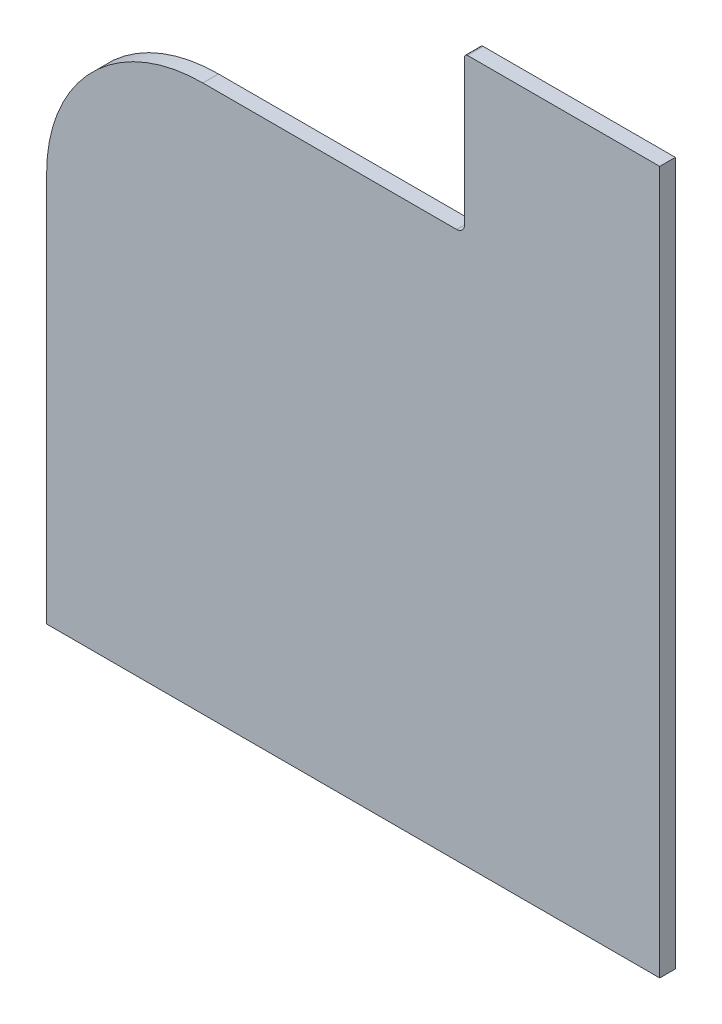
ISO-10303-21;
HEADER;
FILE_DESCRIPTION(('STEP AP214'),'2;1');
FILE_NAME('part.step','',(''),(''),'','','');
FILE_SCHEMA(('AUTOMOTIVE_DESIGN { 1 0 10303 214 1 1 1 1 }'));
ENDSEC;
DATA;
#1=APPLICATION_CONTEXT('core data for automotive mechanical design processes');
#2=APPLICATION_PROTOCOL_DEFINITION('international standard','automotive_design',2000,#1);
#3=PRODUCT_CONTEXT('',#1,'mechanical');
#4=PRODUCT('Part','Part','',(#3));
#5=PRODUCT_RELATED_PRODUCT_CATEGORY('part','',(#4));
#6=PRODUCT_DEFINITION_FORMATION('','',#4);
#7=PRODUCT_DEFINITION_CONTEXT('part definition',#1,'design');
#8=PRODUCT_DEFINITION('design','',#6,#7);
#9=PRODUCT_DEFINITION_SHAPE('','',#8);
#10=(LENGTH_UNIT() NAMED_UNIT(*) SI_UNIT(.MILLI.,.METRE.));
#11=(NAMED_UNIT(*) PLANE_ANGLE_UNIT() SI_UNIT($,.RADIAN.));
#12=(NAMED_UNIT(*) SI_UNIT($,.STERADIAN.) SOLID_ANGLE_UNIT());
#13=UNCERTAINTY_MEASURE_WITH_UNIT(LENGTH_MEASURE(1.E-05),#10,'distance_accuracy_value','');
#14=(GEOMETRIC_REPRESENTATION_CONTEXT(3) GLOBAL_UNCERTAINTY_ASSIGNED_CONTEXT((#13)) GLOBAL_UNIT_ASSIGNED_CONTEXT((#10,
#11,#12)) REPRESENTATION_CONTEXT('',''));
#15=CARTESIAN_POINT('',(0.,0.,0.));
#16=DIRECTION('',(0.,0.,1.));
#17=DIRECTION('',(1.,0.,0.));
#18=AXIS2_PLACEMENT_3D('',#15,#16,#17);
#19=CARTESIAN_POINT('',(285.,99.9999999999999,20.));
#20=DIRECTION('',(-1.,0.,0.));
#21=DIRECTION('',(0.,0.,1.));
#22=AXIS2_PLACEMENT_3D('',#19,#20,#21);
#23=PLANE('',#22);
#24=DIRECTION('',(0.,1.,0.));
#25=VECTOR('',#24,1.);
#26=CARTESIAN_POINT('',(285.,99.9999999999999,0.));
#27=LINE('',#26,#25);
#28=CARTESIAN_POINT('',(285.,-300.,0.));
#29=VERTEX_POINT('',#28);
#30=CARTESIAN_POINT('',(285.,600.,0.));
#31=VERTEX_POINT('',#30);
#32=EDGE_CURVE('E119',#29,#31,#27,.T.);
#33=ORIENTED_EDGE('',*,*,#32,.T.);
#34=DIRECTION('',(0.,0.,-1.));
#35=VECTOR('',#34,1.);
#36=CARTESIAN_POINT('',(285.,600.,20.));
#37=LINE('',#36,#35);
#38=CARTESIAN_POINT('',(285.,600.,20.));
#39=VERTEX_POINT('',#38);
#40=EDGE_CURVE('E118',#39,#31,#37,.T.);
#41=ORIENTED_EDGE('',*,*,#40,.F.);
#42=DIRECTION('',(0.,1.,0.));
#43=VECTOR('',#42,1.);
#44=CARTESIAN_POINT('',(285.,99.9999999999999,20.));
#45=LINE('',#44,#43);
#46=CARTESIAN_POINT('',(285.,-300.,20.));
#47=VERTEX_POINT('',#46);
#48=EDGE_CURVE('E105',#47,#39,#45,.T.);
#49=ORIENTED_EDGE('',*,*,#48,.F.);
#50=DIRECTION('',(0.,0.,-1.));
#51=VECTOR('',#50,1.);
#52=CARTESIAN_POINT('',(285.,-300.,20.));
#53=LINE('',#52,#51);
#54=EDGE_CURVE('E137',#47,#29,#53,.T.);
#55=ORIENTED_EDGE('',*,*,#54,.T.);
#56=EDGE_LOOP('',(#33,#41,#49,#55));
#57=FACE_BOUND('',#56,.T.);
#58=ADVANCED_FACE('F35',(#57),#23,.F.);
#59=CARTESIAN_POINT('',(285.,600.,20.));
#60=DIRECTION('',(0.,-1.,0.));
#61=DIRECTION('',(0.,0.,-1.));
#62=AXIS2_PLACEMENT_3D('',#59,#60,#61);
#63=PLANE('',#62);
#64=DIRECTION('',(-1.,0.,0.));
#65=VECTOR('',#64,1.);
#66=CARTESIAN_POINT('',(285.,600.,0.));
#67=LINE('',#66,#65);
#68=CARTESIAN_POINT('',(39.0000000000001,600.,0.));
#69=VERTEX_POINT('',#68);
#70=EDGE_CURVE('E139',#31,#69,#67,.T.);
#71=ORIENTED_EDGE('',*,*,#70,.T.);
#72=DIRECTION('',(0.,0.,-1.));
#73=VECTOR('',#72,1.);
#74=CARTESIAN_POINT('',(39.0000000000001,600.,20.));
#75=LINE('',#74,#73);
#76=CARTESIAN_POINT('',(39.0000000000001,600.,20.));
#77=VERTEX_POINT('',#76);
#78=EDGE_CURVE('E43',#69,#77,#75,.F.);
#79=ORIENTED_EDGE('',*,*,#78,.T.);
#80=DIRECTION('',(-1.,0.,0.));
#81=VECTOR('',#80,1.);
#82=CARTESIAN_POINT('',(285.,600.,20.));
#83=LINE('',#82,#81);
#84=EDGE_CURVE('E108',#39,#77,#83,.T.);
#85=ORIENTED_EDGE('',*,*,#84,.F.);
#86=ORIENTED_EDGE('',*,*,#40,.T.);
#87=EDGE_LOOP('',(#71,#79,#85,#86));
#88=FACE_BOUND('',#87,.T.);
#89=ADVANCED_FACE('F123',(#88),#63,.F.);
#90=CARTESIAN_POINT('',(35.0000000000001,600.,20.));
#91=DIRECTION('',(1.,0.,0.));
#92=DIRECTION('',(0.,1.,0.));
#93=AXIS2_PLACEMENT_3D('',#90,#91,#92);
#94=PLANE('',#93);
#95=DIRECTION('',(0.,-1.,0.));
#96=VECTOR('',#95,1.);
#97=CARTESIAN_POINT('',(35.0000000000001,600.,20.));
#98=LINE('',#97,#96);
#99=CARTESIAN_POINT('',(35.0000000000001,596.,20.));
#100=VERTEX_POINT('',#99);
#101=CARTESIAN_POINT('',(35.0000000000001,410.,20.));
#102=VERTEX_POINT('',#101);
#103=EDGE_CURVE('E124',#100,#102,#98,.T.);
#104=ORIENTED_EDGE('',*,*,#103,.F.);
#105=DIRECTION('',(0.,0.,-1.));
#106=VECTOR('',#105,1.);
#107=CARTESIAN_POINT('',(35.0000000000001,596.,20.));
#108=LINE('',#107,#106);
#109=CARTESIAN_POINT('',(35.0000000000001,596.,0.));
#110=VERTEX_POINT('',#109);
#111=EDGE_CURVE('E120',#100,#110,#108,.T.);
#112=ORIENTED_EDGE('',*,*,#111,.T.);
#113=DIRECTION('',(0.,-1.,0.));
#114=VECTOR('',#113,1.);
#115=CARTESIAN_POINT('',(35.0000000000001,600.,0.));
#116=LINE('',#115,#114);
#117=CARTESIAN_POINT('',(35.0000000000001,410.,0.));
#118=VERTEX_POINT('',#117);
#119=EDGE_CURVE('E141',#110,#118,#116,.T.);
#120=ORIENTED_EDGE('',*,*,#119,.T.);
#121=DIRECTION('',(0.,0.,-1.));
#122=VECTOR('',#121,1.);
#123=CARTESIAN_POINT('',(35.0000000000001,410.,20.));
#124=LINE('',#123,#122);
#125=EDGE_CURVE('E121',#102,#118,#124,.T.);
#126=ORIENTED_EDGE('',*,*,#125,.F.);
#127=EDGE_LOOP('',(#104,#112,#120,#126));
#128=FACE_BOUND('',#127,.T.);
#129=ADVANCED_FACE('F173',(#128),#94,.F.);
#130=CARTESIAN_POINT('',(25.0000000000001,410.,20.));
#131=DIRECTION('',(0.,0.,-1.));
#132=DIRECTION('',(-1.,0.,0.));
#133=AXIS2_PLACEMENT_3D('',#130,#131,#132);
#134=CYLINDRICAL_SURFACE('',#133,10.);
#135=CARTESIAN_POINT('',(25.0000000000001,410.,0.));
#136=DIRECTION('',(0.,0.,-1.));
#137=DIRECTION('',(-1.,0.,0.));
#138=AXIS2_PLACEMENT_3D('',#135,#136,#137);
#139=CIRCLE('',#138,10.);
#140=CARTESIAN_POINT('',(25.0000000000001,400.,0.));
#141=VERTEX_POINT('',#140);
#142=EDGE_CURVE('E143',#118,#141,#139,.T.);
#143=ORIENTED_EDGE('',*,*,#142,.T.);
#144=DIRECTION('',(0.,0.,-1.));
#145=VECTOR('',#144,1.);
#146=CARTESIAN_POINT('',(25.0000000000001,400.,20.));
#147=LINE('',#146,#145);
#148=CARTESIAN_POINT('',(25.0000000000001,400.,20.));
#149=VERTEX_POINT('',#148);
#150=EDGE_CURVE('E163',#149,#141,#147,.T.);
#151=ORIENTED_EDGE('',*,*,#150,.F.);
#152=CARTESIAN_POINT('',(25.0000000000001,410.,20.));
#153=DIRECTION('',(0.,0.,-1.));
#154=DIRECTION('',(-1.,0.,0.));
#155=AXIS2_PLACEMENT_3D('',#152,#153,#154);
#156=CIRCLE('',#155,10.);
#157=EDGE_CURVE('E126',#102,#149,#156,.T.);
#158=ORIENTED_EDGE('',*,*,#157,.F.);
#159=ORIENTED_EDGE('',*,*,#125,.T.);
#160=EDGE_LOOP('',(#143,#151,#158,#159));
#161=FACE_BOUND('',#160,.T.);
#162=ADVANCED_FACE('F182',(#161),#134,.F.);
#163=CARTESIAN_POINT('',(-299.999999999999,400.,20.));
#164=DIRECTION('',(0.,-1.,0.));
#165=DIRECTION('',(0.,0.,-1.));
#166=AXIS2_PLACEMENT_3D('',#163,#164,#165);
#167=PLANE('',#166);
#168=DIRECTION('',(-1.,0.,0.));
#169=VECTOR('',#168,1.);
#170=CARTESIAN_POINT('',(-299.999999999999,400.,0.));
#171=LINE('',#170,#169);
#172=CARTESIAN_POINT('',(-299.999999999999,400.,0.));
#173=VERTEX_POINT('',#172);
#174=EDGE_CURVE('E145',#141,#173,#171,.T.);
#175=ORIENTED_EDGE('',*,*,#174,.T.);
#176=DIRECTION('',(0.,0.,-1.));
#177=VECTOR('',#176,1.);
#178=CARTESIAN_POINT('',(-299.999999999999,400.,20.));
#179=LINE('',#178,#177);
#180=CARTESIAN_POINT('',(-299.999999999999,400.,20.));
#181=VERTEX_POINT('',#180);
#182=EDGE_CURVE('E160',#181,#173,#179,.T.);
#183=ORIENTED_EDGE('',*,*,#182,.F.);
#184=DIRECTION('',(-1.,0.,0.));
#185=VECTOR('',#184,1.);
#186=CARTESIAN_POINT('',(-299.999999999999,400.,20.));
#187=LINE('',#186,#185);
#188=EDGE_CURVE('E130',#149,#181,#187,.T.);
#189=ORIENTED_EDGE('',*,*,#188,.F.);
#190=ORIENTED_EDGE('',*,*,#150,.T.);
#191=EDGE_LOOP('',(#175,#183,#189,#190));
#192=FACE_BOUND('',#191,.T.);
#193=ADVANCED_FACE('F186',(#192),#167,.F.);
#194=CARTESIAN_POINT('',(-300.,200.,20.));
#195=DIRECTION('',(0.,0.,-1.));
#196=DIRECTION('',(-1.,0.,0.));
#197=AXIS2_PLACEMENT_3D('',#194,#195,#196);
#198=CYLINDRICAL_SURFACE('',#197,200.);
#199=CARTESIAN_POINT('',(-300.,200.,0.));
#200=DIRECTION('',(0.,0.,1.));
#201=DIRECTION('',(1.,0.,0.));
#202=AXIS2_PLACEMENT_3D('',#199,#200,#201);
#203=CIRCLE('',#202,200.);
#204=CARTESIAN_POINT('',(-500.,199.999999999999,0.));
#205=VERTEX_POINT('',#204);
#206=EDGE_CURVE('E147',#173,#205,#203,.T.);
#207=ORIENTED_EDGE('',*,*,#206,.T.);
#208=DIRECTION('',(0.,0.,-1.));
#209=VECTOR('',#208,1.);
#210=CARTESIAN_POINT('',(-500.,199.999999999999,20.));
#211=LINE('',#210,#209);
#212=CARTESIAN_POINT('',(-500.,199.999999999999,20.));
#213=VERTEX_POINT('',#212);
#214=EDGE_CURVE('E157',#213,#205,#211,.T.);
#215=ORIENTED_EDGE('',*,*,#214,.F.);
#216=CARTESIAN_POINT('',(-300.,200.,20.));
#217=DIRECTION('',(0.,0.,1.));
#218=DIRECTION('',(1.,0.,0.));
#219=AXIS2_PLACEMENT_3D('',#216,#217,#218);
#220=CIRCLE('',#219,200.);
#221=EDGE_CURVE('E132',#181,#213,#220,.T.);
#222=ORIENTED_EDGE('',*,*,#221,.F.);
#223=ORIENTED_EDGE('',*,*,#182,.T.);
#224=EDGE_LOOP('',(#207,#215,#222,#223));
#225=FACE_BOUND('',#224,.T.);
#226=ADVANCED_FACE('F207',(#225),#198,.T.);
#227=CARTESIAN_POINT('',(-500.,199.999999999999,20.));
#228=DIRECTION('',(1.,0.,0.));
#229=DIRECTION('',(0.,1.,0.));
#230=AXIS2_PLACEMENT_3D('',#227,#228,#229);
#231=PLANE('',#230);
#232=DIRECTION('',(0.,-1.,0.));
#233=VECTOR('',#232,1.);
#234=CARTESIAN_POINT('',(-500.,199.999999999999,0.));
#235=LINE('',#234,#233);
#236=CARTESIAN_POINT('',(-500.,-300.,0.));
#237=VERTEX_POINT('',#236);
#238=EDGE_CURVE('E149',#205,#237,#235,.T.);
#239=ORIENTED_EDGE('',*,*,#238,.T.);
#240=DIRECTION('',(0.,0.,-1.));
#241=VECTOR('',#240,1.);
#242=CARTESIAN_POINT('',(-500.,-300.,20.));
#243=LINE('',#242,#241);
#244=CARTESIAN_POINT('',(-500.,-300.,20.));
#245=VERTEX_POINT('',#244);
#246=EDGE_CURVE('E154',#245,#237,#243,.T.);
#247=ORIENTED_EDGE('',*,*,#246,.F.);
#248=DIRECTION('',(0.,-1.,0.));
#249=VECTOR('',#248,1.);
#250=CARTESIAN_POINT('',(-500.,199.999999999999,20.));
#251=LINE('',#250,#249);
#252=EDGE_CURVE('E134',#213,#245,#251,.T.);
#253=ORIENTED_EDGE('',*,*,#252,.F.);
#254=ORIENTED_EDGE('',*,*,#214,.T.);
#255=EDGE_LOOP('',(#239,#247,#253,#254));
#256=FACE_BOUND('',#255,.T.);
#257=ADVANCED_FACE('F210',(#256),#231,.F.);
#258=CARTESIAN_POINT('',(-500.,-300.,20.));
#259=DIRECTION('',(0.,1.,0.));
#260=DIRECTION('',(0.,0.,1.));
#261=AXIS2_PLACEMENT_3D('',#258,#259,#260);
#262=PLANE('',#261);
#263=DIRECTION('',(1.,0.,0.));
#264=VECTOR('',#263,1.);
#265=CARTESIAN_POINT('',(-500.,-300.,0.));
#266=LINE('',#265,#264);
#267=EDGE_CURVE('E115',#237,#29,#266,.T.);
#268=ORIENTED_EDGE('',*,*,#267,.T.);
#269=ORIENTED_EDGE('',*,*,#54,.F.);
#270=DIRECTION('',(1.,0.,0.));
#271=VECTOR('',#270,1.);
#272=CARTESIAN_POINT('',(-500.,-300.,20.));
#273=LINE('',#272,#271);
#274=EDGE_CURVE('E111',#245,#47,#273,.T.);
#275=ORIENTED_EDGE('',*,*,#274,.F.);
#276=ORIENTED_EDGE('',*,*,#246,.T.);
#277=EDGE_LOOP('',(#268,#269,#275,#276));
#278=FACE_BOUND('',#277,.T.);
#279=ADVANCED_FACE('F214',(#278),#262,.F.);
#280=CARTESIAN_POINT('',(-300.,200.,20.));
#281=DIRECTION('',(0.,0.,1.));
#282=DIRECTION('',(1.,0.,0.));
#283=AXIS2_PLACEMENT_3D('',#280,#281,#282);
#284=PLANE('',#283);
#285=ORIENTED_EDGE('',*,*,#84,.T.);
#286=CARTESIAN_POINT('',(39.0000000000001,596.,20.));
#287=DIRECTION('',(0.,0.,1.));
#288=DIRECTION('',(1.,0.,0.));
#289=AXIS2_PLACEMENT_3D('',#286,#287,#288);
#290=CIRCLE('',#289,4.);
#291=EDGE_CURVE('E11',#77,#100,#290,.T.);
#292=ORIENTED_EDGE('',*,*,#291,.T.);
#293=ORIENTED_EDGE('',*,*,#103,.T.);
#294=ORIENTED_EDGE('',*,*,#157,.T.);
#295=ORIENTED_EDGE('',*,*,#188,.T.);
#296=ORIENTED_EDGE('',*,*,#221,.T.);
#297=ORIENTED_EDGE('',*,*,#252,.T.);
#298=ORIENTED_EDGE('',*,*,#274,.T.);
#299=ORIENTED_EDGE('',*,*,#48,.T.);
#300=EDGE_LOOP('',(#285,#292,#293,#294,#295,#296,#297,#298,#299));
#301=FACE_BOUND('',#300,.T.);
#302=ADVANCED_FACE('F107',(#301),#284,.T.);
#303=CARTESIAN_POINT('',(-300.,200.,0.));
#304=DIRECTION('',(0.,0.,1.));
#305=DIRECTION('',(1.,0.,0.));
#306=AXIS2_PLACEMENT_3D('',#303,#304,#305);
#307=PLANE('',#306);
#308=ORIENTED_EDGE('',*,*,#119,.F.);
#309=CARTESIAN_POINT('',(39.0000000000001,596.,0.));
#310=DIRECTION('',(0.,0.,1.));
#311=DIRECTION('',(1.,0.,0.));
#312=AXIS2_PLACEMENT_3D('',#309,#310,#311);
#313=CIRCLE('',#312,4.);
#314=EDGE_CURVE('E57',#110,#69,#313,.F.);
#315=ORIENTED_EDGE('',*,*,#314,.T.);
#316=ORIENTED_EDGE('',*,*,#70,.F.);
#317=ORIENTED_EDGE('',*,*,#32,.F.);
#318=ORIENTED_EDGE('',*,*,#267,.F.);
#319=ORIENTED_EDGE('',*,*,#238,.F.);
#320=ORIENTED_EDGE('',*,*,#206,.F.);
#321=ORIENTED_EDGE('',*,*,#174,.F.);
#322=ORIENTED_EDGE('',*,*,#142,.F.);
#323=EDGE_LOOP('',(#308,#315,#316,#317,#318,#319,#320,#321,#322));
#324=FACE_BOUND('',#323,.T.);
#325=ADVANCED_FACE('F177',(#324),#307,.F.);
#326=CARTESIAN_POINT('',(39.0000000000001,596.,20.));
#327=DIRECTION('',(0.,0.,-1.));
#328=DIRECTION('',(-1.,0.,0.));
#329=AXIS2_PLACEMENT_3D('',#326,#327,#328);
#330=CYLINDRICAL_SURFACE('',#329,4.);
#331=ORIENTED_EDGE('',*,*,#291,.F.);
#332=ORIENTED_EDGE('',*,*,#78,.F.);
#333=ORIENTED_EDGE('',*,*,#314,.F.);
#334=ORIENTED_EDGE('',*,*,#111,.F.);
#335=EDGE_LOOP('',(#331,#332,#333,#334));
#336=FACE_BOUND('',#335,.T.);
#337=ADVANCED_FACE('F37',(#336),#330,.T.);
#338=CLOSED_SHELL('',(#58,#89,#129,#162,#193,#226,#257,#279,#302,#325,#337));
#339=MANIFOLD_SOLID_BREP('B2',#338);
#340=ADVANCED_BREP_SHAPE_REPRESENTATION('',(#18,#339),#14);
#341=SHAPE_DEFINITION_REPRESENTATION(#9,#340);
ENDSEC;
END-ISO-10303-21;
